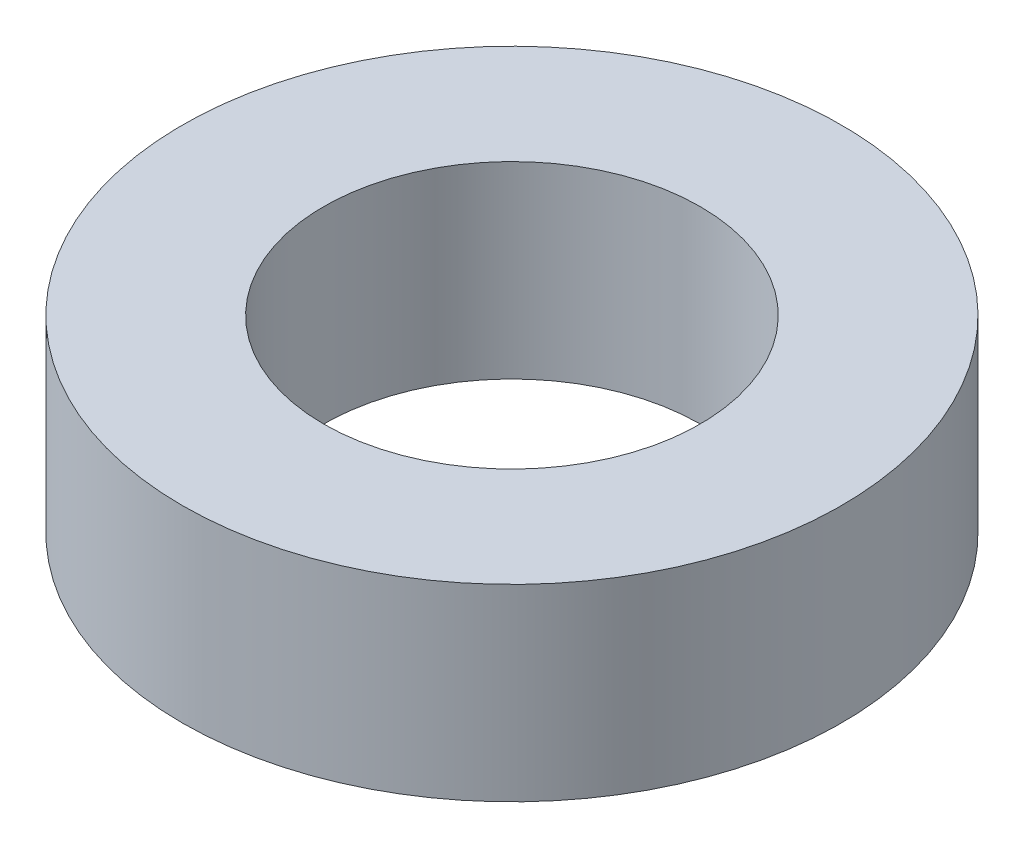
ISO-10303-21;
HEADER;
FILE_DESCRIPTION(('STEP AP214'),'2;1');
FILE_NAME('part.step','',(''),(''),'','','');
FILE_SCHEMA(('AUTOMOTIVE_DESIGN { 1 0 10303 214 1 1 1 1 }'));
ENDSEC;
DATA;
#1=APPLICATION_CONTEXT('core data for automotive mechanical design processes');
#2=APPLICATION_PROTOCOL_DEFINITION('international standard','automotive_design',2000,#1);
#3=PRODUCT_CONTEXT('',#1,'mechanical');
#4=PRODUCT('Part','Part','',(#3));
#5=PRODUCT_RELATED_PRODUCT_CATEGORY('part','',(#4));
#6=PRODUCT_DEFINITION_FORMATION('','',#4);
#7=PRODUCT_DEFINITION_CONTEXT('part definition',#1,'design');
#8=PRODUCT_DEFINITION('design','',#6,#7);
#9=PRODUCT_DEFINITION_SHAPE('','',#8);
#10=(LENGTH_UNIT() NAMED_UNIT(*) SI_UNIT(.MILLI.,.METRE.));
#11=(NAMED_UNIT(*) PLANE_ANGLE_UNIT() SI_UNIT($,.RADIAN.));
#12=(NAMED_UNIT(*) SI_UNIT($,.STERADIAN.) SOLID_ANGLE_UNIT());
#13=UNCERTAINTY_MEASURE_WITH_UNIT(LENGTH_MEASURE(1.E-05),#10,'distance_accuracy_value','');
#14=(GEOMETRIC_REPRESENTATION_CONTEXT(3) GLOBAL_UNCERTAINTY_ASSIGNED_CONTEXT((#13)) GLOBAL_UNIT_ASSIGNED_CONTEXT((#10,
#11,#12)) REPRESENTATION_CONTEXT('',''));
#15=CARTESIAN_POINT('',(0.,0.,0.));
#16=DIRECTION('',(0.,0.,1.));
#17=DIRECTION('',(1.,0.,0.));
#18=AXIS2_PLACEMENT_3D('',#15,#16,#17);
#19=CARTESIAN_POINT('',(0.,2.,0.));
#20=DIRECTION('',(0.,1.,0.));
#21=DIRECTION('',(0.,0.,1.));
#22=AXIS2_PLACEMENT_3D('',#19,#20,#21);
#23=PLANE('',#22);
#24=CARTESIAN_POINT('',(0.,2.,0.));
#25=DIRECTION('',(0.,1.,0.));
#26=DIRECTION('',(0.,0.,1.));
#27=AXIS2_PLACEMENT_3D('',#24,#25,#26);
#28=CIRCLE('',#27,3.5);
#29=CARTESIAN_POINT('',(0.,2.,3.5));
#30=VERTEX_POINT('',#29);
#31=EDGE_CURVE('E10',#30,#30,#28,.T.);
#32=ORIENTED_EDGE('',*,*,#31,.T.);
#33=EDGE_LOOP('',(#32));
#34=FACE_BOUND('',#33,.T.);
#35=CARTESIAN_POINT('',(0.,2.,0.));
#36=DIRECTION('',(0.,1.,0.));
#37=DIRECTION('',(0.,0.,1.));
#38=AXIS2_PLACEMENT_3D('',#35,#36,#37);
#39=CIRCLE('',#38,2.);
#40=CARTESIAN_POINT('',(0.,2.,2.));
#41=VERTEX_POINT('',#40);
#42=EDGE_CURVE('E42',#41,#41,#39,.T.);
#43=ORIENTED_EDGE('',*,*,#42,.F.);
#44=EDGE_LOOP('',(#43));
#45=FACE_BOUND('',#44,.T.);
#46=ADVANCED_FACE('F31',(#34,#45),#23,.T.);
#47=CARTESIAN_POINT('',(0.,0.,0.));
#48=DIRECTION('',(0.,1.,0.));
#49=DIRECTION('',(0.,0.,1.));
#50=AXIS2_PLACEMENT_3D('',#47,#48,#49);
#51=PLANE('',#50);
#52=CARTESIAN_POINT('',(0.,0.,0.));
#53=DIRECTION('',(0.,1.,0.));
#54=DIRECTION('',(0.,0.,1.));
#55=AXIS2_PLACEMENT_3D('',#52,#53,#54);
#56=CIRCLE('',#55,3.5);
#57=CARTESIAN_POINT('',(0.,0.,3.5));
#58=VERTEX_POINT('',#57);
#59=EDGE_CURVE('E35',#58,#58,#56,.T.);
#60=ORIENTED_EDGE('',*,*,#59,.F.);
#61=EDGE_LOOP('',(#60));
#62=FACE_BOUND('',#61,.T.);
#63=CARTESIAN_POINT('',(0.,0.,0.));
#64=DIRECTION('',(0.,1.,0.));
#65=DIRECTION('',(0.,0.,1.));
#66=AXIS2_PLACEMENT_3D('',#63,#64,#65);
#67=CIRCLE('',#66,2.);
#68=CARTESIAN_POINT('',(0.,0.,2.));
#69=VERTEX_POINT('',#68);
#70=EDGE_CURVE('E44',#69,#69,#67,.T.);
#71=ORIENTED_EDGE('',*,*,#70,.T.);
#72=EDGE_LOOP('',(#71));
#73=FACE_BOUND('',#72,.T.);
#74=ADVANCED_FACE('F54',(#62,#73),#51,.F.);
#75=CARTESIAN_POINT('',(0.,2.,0.));
#76=DIRECTION('',(0.,-1.,0.));
#77=DIRECTION('',(0.,0.,-1.));
#78=AXIS2_PLACEMENT_3D('',#75,#76,#77);
#79=CYLINDRICAL_SURFACE('',#78,3.5);
#80=ORIENTED_EDGE('',*,*,#31,.F.);
#81=EDGE_LOOP('',(#80));
#82=FACE_BOUND('',#81,.T.);
#83=ORIENTED_EDGE('',*,*,#59,.T.);
#84=EDGE_LOOP('',(#83));
#85=FACE_BOUND('',#84,.T.);
#86=ADVANCED_FACE('F33',(#82,#85),#79,.T.);
#87=CARTESIAN_POINT('',(0.,2.,0.));
#88=DIRECTION('',(0.,-1.,0.));
#89=DIRECTION('',(0.,0.,-1.));
#90=AXIS2_PLACEMENT_3D('',#87,#88,#89);
#91=CYLINDRICAL_SURFACE('',#90,2.);
#92=ORIENTED_EDGE('',*,*,#42,.T.);
#93=EDGE_LOOP('',(#92));
#94=FACE_BOUND('',#93,.T.);
#95=ORIENTED_EDGE('',*,*,#70,.F.);
#96=EDGE_LOOP('',(#95));
#97=FACE_BOUND('',#96,.T.);
#98=ADVANCED_FACE('F50',(#94,#97),#91,.F.);
#99=CLOSED_SHELL('',(#46,#74,#86,#98));
#100=MANIFOLD_SOLID_BREP('B2',#99);
#101=ADVANCED_BREP_SHAPE_REPRESENTATION('',(#18,#100),#14);
#102=SHAPE_DEFINITION_REPRESENTATION(#9,#101);
ENDSEC;
END-ISO-10303-21;
